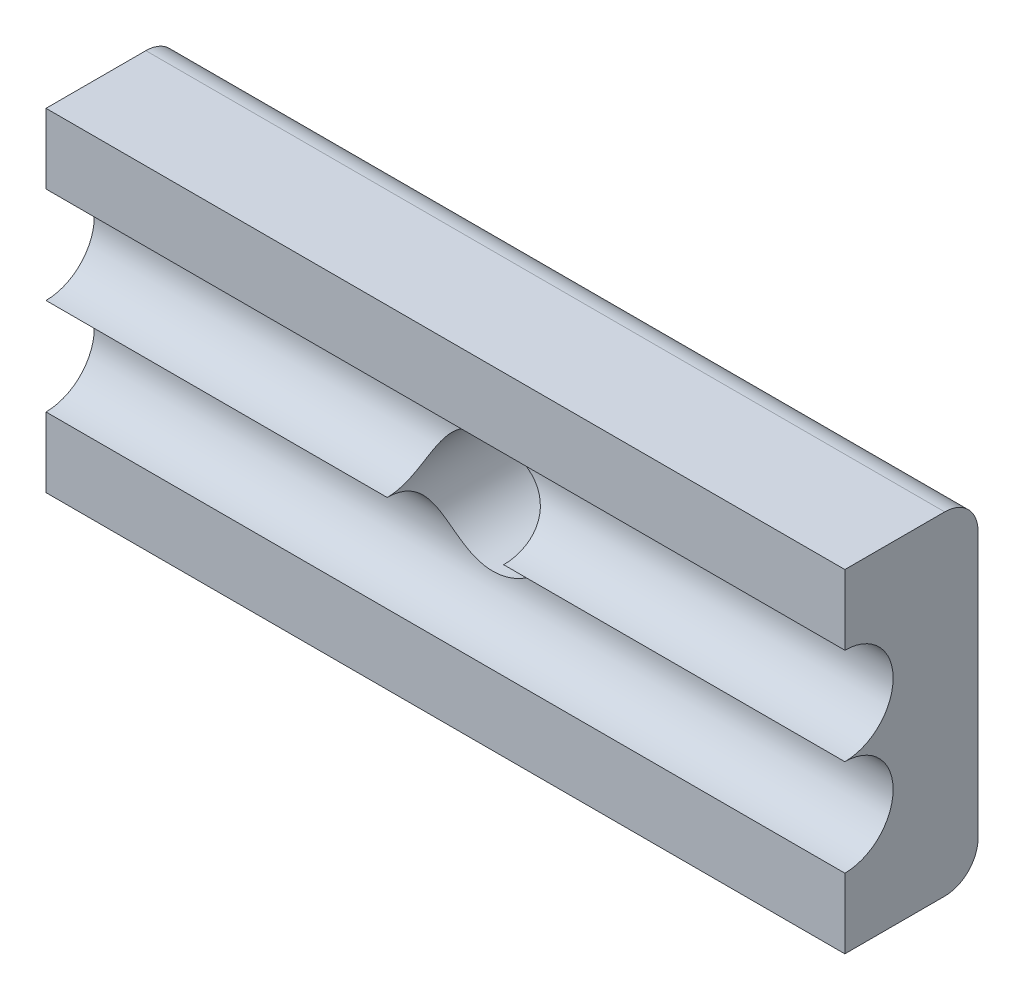
ISO-10303-21;
HEADER;
FILE_DESCRIPTION(('STEP AP214'),'2;1');
FILE_NAME('part.step','',(''),(''),'','','');
FILE_SCHEMA(('AUTOMOTIVE_DESIGN { 1 0 10303 214 1 1 1 1 }'));
ENDSEC;
DATA;
#1=APPLICATION_CONTEXT('core data for automotive mechanical design processes');
#2=APPLICATION_PROTOCOL_DEFINITION('international standard','automotive_design',2000,#1);
#3=PRODUCT_CONTEXT('',#1,'mechanical');
#4=PRODUCT('Part','Part','',(#3));
#5=PRODUCT_RELATED_PRODUCT_CATEGORY('part','',(#4));
#6=PRODUCT_DEFINITION_FORMATION('','',#4);
#7=PRODUCT_DEFINITION_CONTEXT('part definition',#1,'design');
#8=PRODUCT_DEFINITION('design','',#6,#7);
#9=PRODUCT_DEFINITION_SHAPE('','',#8);
#10=(LENGTH_UNIT() NAMED_UNIT(*) SI_UNIT(.MILLI.,.METRE.));
#11=(NAMED_UNIT(*) PLANE_ANGLE_UNIT() SI_UNIT($,.RADIAN.));
#12=(NAMED_UNIT(*) SI_UNIT($,.STERADIAN.) SOLID_ANGLE_UNIT());
#13=UNCERTAINTY_MEASURE_WITH_UNIT(LENGTH_MEASURE(1.E-05),#10,'distance_accuracy_value','');
#14=(GEOMETRIC_REPRESENTATION_CONTEXT(3) GLOBAL_UNCERTAINTY_ASSIGNED_CONTEXT((#13)) GLOBAL_UNIT_ASSIGNED_CONTEXT((#10,
#11,#12)) REPRESENTATION_CONTEXT('',''));
#15=CARTESIAN_POINT('',(0.,0.,0.));
#16=DIRECTION('',(0.,0.,1.));
#17=DIRECTION('',(1.,0.,0.));
#18=AXIS2_PLACEMENT_3D('',#15,#16,#17);
#19=CARTESIAN_POINT('',(0.,0.,4.));
#20=DIRECTION('',(0.,0.,1.));
#21=DIRECTION('',(1.,0.,0.));
#22=AXIS2_PLACEMENT_3D('',#19,#20,#21);
#23=PLANE('',#22);
#24=DIRECTION('',(-1.,0.,0.));
#25=VECTOR('',#24,1.);
#26=CARTESIAN_POINT('',(24.957345971564,1.9,4.));
#27=LINE('',#26,#25);
#28=CARTESIAN_POINT('',(18.957345971564,1.9,4.));
#29=VERTEX_POINT('',#28);
#30=CARTESIAN_POINT('',(-5.04265402843602,1.9,4.));
#31=VERTEX_POINT('',#30);
#32=EDGE_CURVE('E130',#29,#31,#27,.T.);
#33=ORIENTED_EDGE('',*,*,#32,.F.);
#34=DIRECTION('',(0.,1.,0.));
#35=VECTOR('',#34,1.);
#36=CARTESIAN_POINT('',(18.957345971564,4.,4.));
#37=LINE('',#36,#35);
#38=CARTESIAN_POINT('',(18.957345971564,4.,4.));
#39=VERTEX_POINT('',#38);
#40=EDGE_CURVE('E157',#29,#39,#37,.T.);
#41=ORIENTED_EDGE('',*,*,#40,.T.);
#42=DIRECTION('',(-1.,0.,0.));
#43=VECTOR('',#42,1.);
#44=CARTESIAN_POINT('',(-5.04265402843602,4.,4.));
#45=LINE('',#44,#43);
#46=CARTESIAN_POINT('',(-5.04265402843602,4.,4.));
#47=VERTEX_POINT('',#46);
#48=EDGE_CURVE('E152',#39,#47,#45,.T.);
#49=ORIENTED_EDGE('',*,*,#48,.T.);
#50=DIRECTION('',(0.,-1.,0.));
#51=VECTOR('',#50,1.);
#52=CARTESIAN_POINT('',(-5.04265402843602,4.,4.));
#53=LINE('',#52,#51);
#54=EDGE_CURVE('E147',#47,#31,#53,.T.);
#55=ORIENTED_EDGE('',*,*,#54,.T.);
#56=EDGE_LOOP('',(#33,#41,#49,#55));
#57=FACE_BOUND('',#56,.T.);
#58=ADVANCED_FACE('F45',(#57),#23,.T.);
#59=CARTESIAN_POINT('',(-5.04265402843602,4.,4.));
#60=DIRECTION('',(1.,0.,0.));
#61=DIRECTION('',(0.,1.,0.));
#62=AXIS2_PLACEMENT_3D('',#59,#60,#61);
#63=PLANE('',#62);
#64=CARTESIAN_POINT('',(-5.04265402843602,-2.45,4.));
#65=DIRECTION('',(-1.,0.,0.));
#66=DIRECTION('',(0.,0.,1.));
#67=AXIS2_PLACEMENT_3D('',#64,#65,#66);
#68=CIRCLE('',#67,1.45);
#69=CARTESIAN_POINT('',(-5.04265402843602,-1.,4.));
#70=VERTEX_POINT('',#69);
#71=CARTESIAN_POINT('',(-5.04265402843602,-3.9,4.));
#72=VERTEX_POINT('',#71);
#73=EDGE_CURVE('E149',#70,#72,#68,.T.);
#74=ORIENTED_EDGE('',*,*,#73,.F.);
#75=CARTESIAN_POINT('',(-5.04265402843602,0.449999999999999,4.));
#76=DIRECTION('',(-1.,0.,0.));
#77=DIRECTION('',(0.,0.,1.));
#78=AXIS2_PLACEMENT_3D('',#75,#76,#77);
#79=CIRCLE('',#78,1.45);
#80=EDGE_CURVE('E133',#31,#70,#79,.T.);
#81=ORIENTED_EDGE('',*,*,#80,.F.);
#82=ORIENTED_EDGE('',*,*,#54,.F.);
#83=DIRECTION('',(0.,0.,-1.));
#84=VECTOR('',#83,1.);
#85=CARTESIAN_POINT('',(-5.04265402843602,4.,4.));
#86=LINE('',#85,#84);
#87=CARTESIAN_POINT('',(-5.04265402843602,4.,1.));
#88=VERTEX_POINT('',#87);
#89=EDGE_CURVE('E168',#47,#88,#86,.T.);
#90=ORIENTED_EDGE('',*,*,#89,.T.);
#91=CARTESIAN_POINT('',(-5.04265402843602,3.,1.));
#92=DIRECTION('',(1.,0.,0.));
#93=DIRECTION('',(0.,1.,0.));
#94=AXIS2_PLACEMENT_3D('',#91,#92,#93);
#95=CIRCLE('',#94,1.);
#96=CARTESIAN_POINT('',(-5.04265402843602,3.,0.));
#97=VERTEX_POINT('',#96);
#98=EDGE_CURVE('E66',#88,#97,#95,.F.);
#99=ORIENTED_EDGE('',*,*,#98,.T.);
#100=DIRECTION('',(0.,-1.,0.));
#101=VECTOR('',#100,1.);
#102=CARTESIAN_POINT('',(-5.04265402843602,4.,0.));
#103=LINE('',#102,#101);
#104=CARTESIAN_POINT('',(-5.04265402843602,-5.,0.));
#105=VERTEX_POINT('',#104);
#106=EDGE_CURVE('E169',#97,#105,#103,.T.);
#107=ORIENTED_EDGE('',*,*,#106,.T.);
#108=CARTESIAN_POINT('',(-5.04265402843602,-5.,1.));
#109=DIRECTION('',(1.,0.,0.));
#110=DIRECTION('',(0.,1.,0.));
#111=AXIS2_PLACEMENT_3D('',#108,#109,#110);
#112=CIRCLE('',#111,1.);
#113=CARTESIAN_POINT('',(-5.04265402843602,-6.,1.));
#114=VERTEX_POINT('',#113);
#115=EDGE_CURVE('E197',#105,#114,#112,.F.);
#116=ORIENTED_EDGE('',*,*,#115,.T.);
#117=DIRECTION('',(0.,0.,-1.));
#118=VECTOR('',#117,1.);
#119=CARTESIAN_POINT('',(-5.04265402843602,-6.,4.));
#120=LINE('',#119,#118);
#121=CARTESIAN_POINT('',(-5.04265402843602,-6.,4.));
#122=VERTEX_POINT('',#121);
#123=EDGE_CURVE('E181',#122,#114,#120,.T.);
#124=ORIENTED_EDGE('',*,*,#123,.F.);
#125=EDGE_CURVE('E155',#72,#122,#53,.T.);
#126=ORIENTED_EDGE('',*,*,#125,.F.);
#127=EDGE_LOOP('',(#74,#81,#82,#90,#99,#107,#116,#124,#126));
#128=FACE_BOUND('',#127,.T.);
#129=ADVANCED_FACE('F145',(#128),#63,.F.);
#130=CARTESIAN_POINT('',(-5.04265402843602,-6.,4.));
#131=DIRECTION('',(0.,1.,0.));
#132=DIRECTION('',(0.,0.,1.));
#133=AXIS2_PLACEMENT_3D('',#130,#131,#132);
#134=PLANE('',#133);
#135=ORIENTED_EDGE('',*,*,#123,.T.);
#136=DIRECTION('',(1.,0.,0.));
#137=VECTOR('',#136,1.);
#138=CARTESIAN_POINT('',(-5.04265402843602,-6.,1.));
#139=LINE('',#138,#137);
#140=CARTESIAN_POINT('',(18.957345971564,-6.,1.));
#141=VERTEX_POINT('',#140);
#142=EDGE_CURVE('E184',#114,#141,#139,.T.);
#143=ORIENTED_EDGE('',*,*,#142,.T.);
#144=DIRECTION('',(0.,0.,-1.));
#145=VECTOR('',#144,1.);
#146=CARTESIAN_POINT('',(18.957345971564,-6.,4.));
#147=LINE('',#146,#145);
#148=CARTESIAN_POINT('',(18.957345971564,-6.,4.));
#149=VERTEX_POINT('',#148);
#150=EDGE_CURVE('E178',#149,#141,#147,.T.);
#151=ORIENTED_EDGE('',*,*,#150,.F.);
#152=DIRECTION('',(1.,0.,0.));
#153=VECTOR('',#152,1.);
#154=CARTESIAN_POINT('',(-5.04265402843602,-6.,4.));
#155=LINE('',#154,#153);
#156=EDGE_CURVE('E154',#122,#149,#155,.T.);
#157=ORIENTED_EDGE('',*,*,#156,.F.);
#158=EDGE_LOOP('',(#135,#143,#151,#157));
#159=FACE_BOUND('',#158,.T.);
#160=ADVANCED_FACE('F212',(#159),#134,.F.);
#161=CARTESIAN_POINT('',(18.957345971564,4.,4.));
#162=DIRECTION('',(-1.,0.,0.));
#163=DIRECTION('',(0.,0.,1.));
#164=AXIS2_PLACEMENT_3D('',#161,#162,#163);
#165=PLANE('',#164);
#166=ORIENTED_EDGE('',*,*,#40,.F.);
#167=CARTESIAN_POINT('',(18.957345971564,0.449999999999999,4.));
#168=DIRECTION('',(-1.,0.,0.));
#169=DIRECTION('',(0.,0.,1.));
#170=AXIS2_PLACEMENT_3D('',#167,#168,#169);
#171=CIRCLE('',#170,1.45);
#172=CARTESIAN_POINT('',(18.957345971564,-1.,4.));
#173=VERTEX_POINT('',#172);
#174=EDGE_CURVE('E136',#29,#173,#171,.T.);
#175=ORIENTED_EDGE('',*,*,#174,.T.);
#176=CARTESIAN_POINT('',(18.957345971564,-2.45,4.));
#177=DIRECTION('',(-1.,0.,0.));
#178=DIRECTION('',(0.,0.,1.));
#179=AXIS2_PLACEMENT_3D('',#176,#177,#178);
#180=CIRCLE('',#179,1.45);
#181=CARTESIAN_POINT('',(18.957345971564,-3.9,4.));
#182=VERTEX_POINT('',#181);
#183=EDGE_CURVE('E161',#173,#182,#180,.T.);
#184=ORIENTED_EDGE('',*,*,#183,.T.);
#185=EDGE_CURVE('E164',#149,#182,#37,.T.);
#186=ORIENTED_EDGE('',*,*,#185,.F.);
#187=ORIENTED_EDGE('',*,*,#150,.T.);
#188=CARTESIAN_POINT('',(18.957345971564,-5.,1.));
#189=DIRECTION('',(-1.,0.,0.));
#190=DIRECTION('',(0.,0.,1.));
#191=AXIS2_PLACEMENT_3D('',#188,#189,#190);
#192=CIRCLE('',#191,1.);
#193=CARTESIAN_POINT('',(18.957345971564,-5.,0.));
#194=VERTEX_POINT('',#193);
#195=EDGE_CURVE('E191',#141,#194,#192,.F.);
#196=ORIENTED_EDGE('',*,*,#195,.T.);
#197=DIRECTION('',(0.,1.,0.));
#198=VECTOR('',#197,1.);
#199=CARTESIAN_POINT('',(18.957345971564,4.,0.));
#200=LINE('',#199,#198);
#201=CARTESIAN_POINT('',(18.957345971564,3.,0.));
#202=VERTEX_POINT('',#201);
#203=EDGE_CURVE('E159',#194,#202,#200,.T.);
#204=ORIENTED_EDGE('',*,*,#203,.T.);
#205=CARTESIAN_POINT('',(18.957345971564,3.,1.));
#206=DIRECTION('',(-1.,0.,0.));
#207=DIRECTION('',(0.,0.,1.));
#208=AXIS2_PLACEMENT_3D('',#205,#206,#207);
#209=CIRCLE('',#208,1.);
#210=CARTESIAN_POINT('',(18.957345971564,4.,1.));
#211=VERTEX_POINT('',#210);
#212=EDGE_CURVE('E189',#202,#211,#209,.F.);
#213=ORIENTED_EDGE('',*,*,#212,.T.);
#214=DIRECTION('',(0.,0.,-1.));
#215=VECTOR('',#214,1.);
#216=CARTESIAN_POINT('',(18.957345971564,4.,4.));
#217=LINE('',#216,#215);
#218=EDGE_CURVE('E175',#39,#211,#217,.T.);
#219=ORIENTED_EDGE('',*,*,#218,.F.);
#220=EDGE_LOOP('',(#166,#175,#184,#186,#187,#196,#204,#213,#219));
#221=FACE_BOUND('',#220,.T.);
#222=ADVANCED_FACE('F205',(#221),#165,.F.);
#223=CARTESIAN_POINT('',(-5.04265402843602,4.,4.));
#224=DIRECTION('',(0.,-1.,0.));
#225=DIRECTION('',(0.,0.,-1.));
#226=AXIS2_PLACEMENT_3D('',#223,#224,#225);
#227=PLANE('',#226);
#228=ORIENTED_EDGE('',*,*,#218,.T.);
#229=DIRECTION('',(-1.,0.,0.));
#230=VECTOR('',#229,1.);
#231=CARTESIAN_POINT('',(-5.04265402843602,4.,1.));
#232=LINE('',#231,#230);
#233=EDGE_CURVE('E59',#211,#88,#232,.T.);
#234=ORIENTED_EDGE('',*,*,#233,.T.);
#235=ORIENTED_EDGE('',*,*,#89,.F.);
#236=ORIENTED_EDGE('',*,*,#48,.F.);
#237=EDGE_LOOP('',(#228,#234,#235,#236));
#238=FACE_BOUND('',#237,.T.);
#239=ADVANCED_FACE('F199',(#238),#227,.F.);
#240=DIRECTION('',(-1.,0.,0.));
#241=VECTOR('',#240,1.);
#242=CARTESIAN_POINT('',(24.957345971564,-3.9,4.));
#243=LINE('',#242,#241);
#244=EDGE_CURVE('E218',#182,#72,#243,.T.);
#245=ORIENTED_EDGE('',*,*,#244,.T.);
#246=ORIENTED_EDGE('',*,*,#125,.T.);
#247=ORIENTED_EDGE('',*,*,#156,.T.);
#248=ORIENTED_EDGE('',*,*,#185,.T.);
#249=EDGE_LOOP('',(#245,#246,#247,#248));
#250=FACE_BOUND('',#249,.T.);
#251=ADVANCED_FACE('F217',(#250),#23,.T.);
#252=CARTESIAN_POINT('',(0.,0.,0.));
#253=DIRECTION('',(0.,0.,1.));
#254=DIRECTION('',(1.,0.,0.));
#255=AXIS2_PLACEMENT_3D('',#252,#253,#254);
#256=PLANE('',#255);
#257=CARTESIAN_POINT('',(6.95734597156398,-1.,0.));
#258=DIRECTION('',(0.,0.,1.));
#259=DIRECTION('',(1.,0.,0.));
#260=AXIS2_PLACEMENT_3D('',#257,#258,#259);
#261=CIRCLE('',#260,1.75);
#262=CARTESIAN_POINT('',(8.70734597156398,-1.,0.));
#263=VERTEX_POINT('',#262);
#264=EDGE_CURVE('E171',#263,#263,#261,.T.);
#265=ORIENTED_EDGE('',*,*,#264,.T.);
#266=EDGE_LOOP('',(#265));
#267=FACE_BOUND('',#266,.T.);
#268=ORIENTED_EDGE('',*,*,#203,.F.);
#269=DIRECTION('',(1.,0.,0.));
#270=VECTOR('',#269,1.);
#271=CARTESIAN_POINT('',(0.,-5.,0.));
#272=LINE('',#271,#270);
#273=EDGE_CURVE('E74',#194,#105,#272,.F.);
#274=ORIENTED_EDGE('',*,*,#273,.T.);
#275=ORIENTED_EDGE('',*,*,#106,.F.);
#276=DIRECTION('',(-1.,0.,0.));
#277=VECTOR('',#276,1.);
#278=CARTESIAN_POINT('',(0.,3.,0.));
#279=LINE('',#278,#277);
#280=EDGE_CURVE('E193',#97,#202,#279,.F.);
#281=ORIENTED_EDGE('',*,*,#280,.T.);
#282=EDGE_LOOP('',(#268,#274,#275,#281));
#283=FACE_BOUND('',#282,.T.);
#284=ADVANCED_FACE('F203',(#267,#283),#256,.F.);
#285=CARTESIAN_POINT('',(6.95734597156398,-1.,-1.));
#286=DIRECTION('',(0.,0.,1.));
#287=DIRECTION('',(1.,0.,0.));
#288=AXIS2_PLACEMENT_3D('',#285,#286,#287);
#289=CYLINDRICAL_SURFACE('',#288,1.75);
#290=CARTESIAN_POINT('',(5.20734597156398,-1.,4.));
#291=CARTESIAN_POINT('',(5.20735628796787,-0.999996233307955,3.95950347170287));
#292=CARTESIAN_POINT('',(5.20734623615223,-1.00169651874957,3.91900882092507));
#293=CARTESIAN_POINT('',(5.20736048938849,-1.008475983876,3.83830406462161));
#294=CARTESIAN_POINT('',(5.20738479379075,-1.01355509966984,3.79809395373006));
#295=CARTESIAN_POINT('',(5.20754292296388,-1.02706946870552,3.71819937660366));
#296=CARTESIAN_POINT('',(5.20767685232293,-1.03550792298866,3.67851544913332));
#297=CARTESIAN_POINT('',(5.20820298378966,-1.05567233962938,3.60000573424634));
#298=CARTESIAN_POINT('',(5.20859518264275,-1.0673982605587,3.56117993602232));
#299=CARTESIAN_POINT('',(5.21043819033338,-1.10742336737427,3.44633214027787));
#300=CARTESIAN_POINT('',(5.21255540910154,-1.14056992740874,3.37193956453441));
#301=CARTESIAN_POINT('',(5.22062480405629,-1.21870168113885,3.22995484600408));
#302=CARTESIAN_POINT('',(5.22657444796822,-1.26367904602915,3.162358246847));
#303=CARTESIAN_POINT('',(5.24457291725175,-1.3624224693536,3.03781091559414));
#304=CARTESIAN_POINT('',(5.25644936844873,-1.41591256647713,2.98061838335936));
#305=CARTESIAN_POINT('',(5.28848554166723,-1.52999312735375,2.87659943638053));
#306=CARTESIAN_POINT('',(5.30863653009887,-1.5905760567279,2.8297621718278));
#307=CARTESIAN_POINT('',(5.35630367173989,-1.70910053475405,2.75176338537125));
#308=CARTESIAN_POINT('',(5.38287989579919,-1.76669880880151,2.71950161011116));
#309=CARTESIAN_POINT('',(5.44440527805058,-1.88191255875245,2.66438935345029));
#310=CARTESIAN_POINT('',(5.47935427559974,-1.93952803430472,2.64153869150749));
#311=CARTESIAN_POINT('',(5.55573571144403,-2.04991879019691,2.60511840940971));
#312=CARTESIAN_POINT('',(5.59687609157522,-2.10279454363909,2.59123306506017));
#313=CARTESIAN_POINT('',(5.68570730350766,-2.20415248561638,2.57005451842911));
#314=CARTESIAN_POINT('',(5.7334005050219,-2.25263307414154,2.56276370821136));
#315=CARTESIAN_POINT('',(5.84045587549127,-2.34939610956544,2.55257950012423));
#316=CARTESIAN_POINT('',(5.90053161601968,-2.39695216282198,2.55032111248084));
#317=CARTESIAN_POINT('',(6.02639946014559,-2.4838127973303,2.54974267812244));
#318=CARTESIAN_POINT('',(6.09219601661633,-2.52311086809718,2.55142572618354));
#319=CARTESIAN_POINT('',(6.24121932472904,-2.59935160342842,2.55711153973906));
#320=CARTESIAN_POINT('',(6.32538667751418,-2.63443751935302,2.56149337456995));
#321=CARTESIAN_POINT('',(6.49816365217053,-2.69113160227651,2.5699022741655));
#322=CARTESIAN_POINT('',(6.5867743026413,-2.71273663281605,2.57392925618317));
#323=CARTESIAN_POINT('',(6.77370533303878,-2.74311373166546,2.5798392153089));
#324=CARTESIAN_POINT('',(6.87222900805988,-2.7506982291386,2.58152101970474));
#325=CARTESIAN_POINT('',(7.06913178301928,-2.74920016543393,2.58120530363571));
#326=CARTESIAN_POINT('',(7.1675108866571,-2.7401180384494,2.57920787902086));
#327=CARTESIAN_POINT('',(7.35937724259397,-2.70592598115926,2.57266353858147));
#328=CARTESIAN_POINT('',(7.45292222792879,-2.68112825617197,2.56816648948252));
#329=CARTESIAN_POINT('',(7.6347365464983,-2.61646917914677,2.55921862613383));
#330=CARTESIAN_POINT('',(7.72300062120785,-2.57659309257076,2.55476786149854));
#331=CARTESIAN_POINT('',(7.89380954184982,-2.48164115030977,2.54955215704365));
#332=CARTESIAN_POINT('',(7.97618390137364,-2.42624748516284,2.54887124389184));
#333=CARTESIAN_POINT('',(8.0915592220454,-2.33360489747453,2.55435009452865));
#334=CARTESIAN_POINT('',(8.12863812223731,-2.30114913500813,2.55725691992886));
#335=CARTESIAN_POINT('',(8.1997593662636,-2.23341700978732,2.56585968006157));
#336=CARTESIAN_POINT('',(8.23380305216163,-2.19814190686118,2.57155437479489));
#337=CARTESIAN_POINT('',(8.31270400953542,-2.10923687749278,2.58959700756132));
#338=CARTESIAN_POINT('',(8.35575995043016,-2.05433921565457,2.60376715046082));
#339=CARTESIAN_POINT('',(8.43387180879001,-1.94183739378567,2.64067423260524));
#340=CARTESIAN_POINT('',(8.46893451988635,-1.88423558267373,2.66340385304469));
#341=CARTESIAN_POINT('',(8.53078241472423,-1.76882849482422,2.71836185540442));
#342=CARTESIAN_POINT('',(8.55754247549406,-1.71102312568498,2.75061850127359));
#343=CARTESIAN_POINT('',(8.60300857643246,-1.59832734334629,2.82454458266642));
#344=CARTESIAN_POINT('',(8.62171231256021,-1.54343776796869,2.86621670574914));
#345=CARTESIAN_POINT('',(8.65153931157698,-1.44148952447236,2.95605390237653));
#346=CARTESIAN_POINT('',(8.66295962528092,-1.39419270411139,3.00385308734594));
#347=CARTESIAN_POINT('',(8.68090977955656,-1.30633705195076,3.10608589552964));
#348=CARTESIAN_POINT('',(8.68743820643928,-1.26578017053515,3.16052143127921));
#349=CARTESIAN_POINT('',(8.69749255780848,-1.18968857244684,3.279255600521));
#350=CARTESIAN_POINT('',(8.70074043134115,-1.15480403214715,3.34399372073236));
#351=CARTESIAN_POINT('',(8.70501084628032,-1.09520541799972,3.47806311938934));
#352=CARTESIAN_POINT('',(8.70603278443627,-1.07049410266791,3.54739563771797));
#353=CARTESIAN_POINT('',(8.70709373356957,-1.03420254664772,3.68036115519717));
#354=CARTESIAN_POINT('',(8.7072374627884,-1.02138800526271,3.74365737226552));
#355=CARTESIAN_POINT('',(8.70732959344063,-1.00856261758939,3.83938855927058));
#356=CARTESIAN_POINT('',(8.70733973950154,-1.00535356266141,3.8714218920228));
#357=CARTESIAN_POINT('',(8.70734630520286,-1.00107208639006,3.93563387905301));
#358=CARTESIAN_POINT('',(8.7073427236325,-0.999999853528685,3.96781254589955));
#359=CARTESIAN_POINT('',(8.70734597156398,-1.,4.));
#360=B_SPLINE_CURVE_WITH_KNOTS('',3,(#290,#291,#292,#293,#294,#295,#296,#297,#298,#299,#300,
#301,#302,#303,#304,#305,#306,#307,#308,#309,#310,#311,#312,#313,#314,#315,#316,#317,#318,#319,
#320,#321,#322,#323,#324,#325,#326,#327,#328,#329,#330,#331,#332,#333,#334,#335,#336,#337,#338,
#339,#340,#341,#342,#343,#344,#345,#346,#347,#348,#349,#350,#351,#352,#353,#354,#355,#356,#357,
#358,#359),.UNSPECIFIED.,.F.,.F.,(4,2,2,2,2,2,2,2,2,2,2,2,2,2,2,2,2,2,2,2,2,2,2,2,2,2,2,2,2,2,2,
2,2,2,4),(0.,0.121450491150878,0.242898685835263,0.36446288395356,0.486025550203311,
0.729150350388306,0.972114670434952,1.20839190408096,1.44442039078178,1.65680662860573,
1.86918879183998,2.07361170715427,2.27810874397028,2.50722300397813,2.73651722253453,
3.00925200180987,3.28205021185212,3.57705108684688,3.87204427668725,4.1613533610251,
4.45094589118067,4.74696796029453,4.89484307179298,5.04265247050917,5.25525370736707,
5.46767357018101,5.68073006254754,5.89384744687994,6.09759770470148,6.30140682090117,
6.52132238183589,6.74129753465547,6.93443222433302,7.03095072760383,7.12747774407541),.UNSPECIFIED.);
#361=CARTESIAN_POINT('',(5.20734597156398,-1.,4.));
#362=VERTEX_POINT('',#361);
#363=CARTESIAN_POINT('',(8.70734597156398,-1.,4.));
#364=VERTEX_POINT('',#363);
#365=EDGE_CURVE('E12',#362,#364,#360,.T.);
#366=ORIENTED_EDGE('',*,*,#365,.T.);
#367=CARTESIAN_POINT('',(8.70734597156398,-1.,4.));
#368=CARTESIAN_POINT('',(8.70733565516009,-1.00000376669205,3.95950347170287));
#369=CARTESIAN_POINT('',(8.70734570697573,-0.998303481250434,3.91900882092507));
#370=CARTESIAN_POINT('',(8.70733145373947,-0.991524016123998,3.83830406462161));
#371=CARTESIAN_POINT('',(8.70730714933721,-0.986444900330157,3.79809395373006));
#372=CARTESIAN_POINT('',(8.70714902016408,-0.972930531294483,3.71819937660366));
#373=CARTESIAN_POINT('',(8.70701509080503,-0.964492077011337,3.67851544913332));
#374=CARTESIAN_POINT('',(8.7064889593383,-0.944327660370616,3.60000573424634));
#375=CARTESIAN_POINT('',(8.70609676048522,-0.932601739441299,3.56117993602232));
#376=CARTESIAN_POINT('',(8.70425375279459,-0.892576632625728,3.44633214027787));
#377=CARTESIAN_POINT('',(8.70213653402643,-0.859430072591264,3.37193956453441));
#378=CARTESIAN_POINT('',(8.69406713907167,-0.781298318861148,3.22995484600408));
#379=CARTESIAN_POINT('',(8.68811749515974,-0.73632095397085,3.162358246847));
#380=CARTESIAN_POINT('',(8.67011902587622,-0.637577530646402,3.03781091559414));
#381=CARTESIAN_POINT('',(8.65824257467923,-0.58408743352287,2.98061838335936));
#382=CARTESIAN_POINT('',(8.62620640146073,-0.470006872646247,2.87659943638053));
#383=CARTESIAN_POINT('',(8.60605541302909,-0.409423943272102,2.8297621718278));
#384=CARTESIAN_POINT('',(8.55838827138807,-0.290899465245946,2.75176338537125));
#385=CARTESIAN_POINT('',(8.53181204732878,-0.233301191198493,2.71950161011116));
#386=CARTESIAN_POINT('',(8.47028666507739,-0.118087441247552,2.66438935345029));
#387=CARTESIAN_POINT('',(8.43533766752823,-0.0604719656952775,2.64153869150749));
#388=CARTESIAN_POINT('',(8.35895623168394,0.0499187901969046,2.60511840940971));
#389=CARTESIAN_POINT('',(8.31781585155274,0.102794543639089,2.59123306506017));
#390=CARTESIAN_POINT('',(8.22898463962031,0.204152485616383,2.57005451842911));
#391=CARTESIAN_POINT('',(8.18129143810607,0.252633074141544,2.56276370821136));
#392=CARTESIAN_POINT('',(8.0742360676367,0.349396109565439,2.55257950012423));
#393=CARTESIAN_POINT('',(8.01416032710829,0.396952162821982,2.55032111248084));
#394=CARTESIAN_POINT('',(7.88829248298237,0.483812797330298,2.54974267812244));
#395=CARTESIAN_POINT('',(7.82249592651164,0.523110868097183,2.55142572618354));
#396=CARTESIAN_POINT('',(7.67347261839893,0.599351603428421,2.55711153973906));
#397=CARTESIAN_POINT('',(7.58930526561379,0.634437519353015,2.56149337456995));
#398=CARTESIAN_POINT('',(7.41652829095744,0.691131602276504,2.5699022741655));
#399=CARTESIAN_POINT('',(7.32791764048666,0.712736632816051,2.57392925618317));
#400=CARTESIAN_POINT('',(7.14098661008918,0.743113731665461,2.5798392153089));
#401=CARTESIAN_POINT('',(7.04246293506809,0.750698229138602,2.58152101970474));
#402=CARTESIAN_POINT('',(6.84556016010869,0.749200165433929,2.58120530363571));
#403=CARTESIAN_POINT('',(6.74718105647086,0.740118038449403,2.57920787902086));
#404=CARTESIAN_POINT('',(6.555314700534,0.70592598115926,2.57266353858147));
#405=CARTESIAN_POINT('',(6.46176971519918,0.68112825617197,2.56816648948252));
#406=CARTESIAN_POINT('',(6.27995539662967,0.616469179146767,2.55921862613383));
#407=CARTESIAN_POINT('',(6.19169132192012,0.576593092570759,2.55476786149854));
#408=CARTESIAN_POINT('',(6.02088240127815,0.48164115030977,2.54955215704365));
#409=CARTESIAN_POINT('',(5.93850804175433,0.426247485162836,2.54887124389183));
#410=CARTESIAN_POINT('',(5.82313272108256,0.333604897474526,2.55435009452865));
#411=CARTESIAN_POINT('',(5.78605382089066,0.301149135008133,2.55725691992886));
#412=CARTESIAN_POINT('',(5.71493257686436,0.233417009787317,2.56585968006157));
#413=CARTESIAN_POINT('',(5.68088889096634,0.19814190686118,2.57155437479489));
#414=CARTESIAN_POINT('',(5.60198793359255,0.109236877492779,2.58959700756132));
#415=CARTESIAN_POINT('',(5.55893199269781,0.0543392156545724,2.60376715046082));
#416=CARTESIAN_POINT('',(5.48082013433796,-0.0581626062143289,2.64067423260524));
#417=CARTESIAN_POINT('',(5.44575742324161,-0.115764417326271,2.66340385304469));
#418=CARTESIAN_POINT('',(5.38390952840373,-0.231171505175781,2.71836185540442));
#419=CARTESIAN_POINT('',(5.3571494676339,-0.288976874315022,2.75061850127359));
#420=CARTESIAN_POINT('',(5.31168336669551,-0.401672656653716,2.82454458266642));
#421=CARTESIAN_POINT('',(5.29297963056775,-0.456562232031308,2.86621670574914));
#422=CARTESIAN_POINT('',(5.26315263155098,-0.558510475527645,2.95605390237653));
#423=CARTESIAN_POINT('',(5.25173231784705,-0.605807295888607,3.00385308734594));
#424=CARTESIAN_POINT('',(5.23378216357141,-0.693662948049236,3.10608589552964));
#425=CARTESIAN_POINT('',(5.22725373668868,-0.734219829464851,3.16052143127921));
#426=CARTESIAN_POINT('',(5.21719938531948,-0.810311427553164,3.279255600521));
#427=CARTESIAN_POINT('',(5.21395151178682,-0.845195967852847,3.34399372073236));
#428=CARTESIAN_POINT('',(5.20968109684765,-0.904794582000283,3.47806311938934));
#429=CARTESIAN_POINT('',(5.20865915869169,-0.929505897332093,3.54739563771797));
#430=CARTESIAN_POINT('',(5.2075982095584,-0.965797453352283,3.68036115519717));
#431=CARTESIAN_POINT('',(5.20745448033956,-0.978611994737294,3.74365737226552));
#432=CARTESIAN_POINT('',(5.20736234968733,-0.99143738241061,3.83938855927058));
#433=CARTESIAN_POINT('',(5.20735220362643,-0.994646437338588,3.8714218920228));
#434=CARTESIAN_POINT('',(5.2073456379251,-0.99892791360994,3.93563387905301));
#435=CARTESIAN_POINT('',(5.20734921949547,-1.00000014647132,3.96781254589955));
#436=CARTESIAN_POINT('',(5.20734597156398,-1.,4.));
#437=B_SPLINE_CURVE_WITH_KNOTS('',3,(#367,#368,#369,#370,#371,#372,#373,#374,#375,#376,#377,
#378,#379,#380,#381,#382,#383,#384,#385,#386,#387,#388,#389,#390,#391,#392,#393,#394,#395,#396,
#397,#398,#399,#400,#401,#402,#403,#404,#405,#406,#407,#408,#409,#410,#411,#412,#413,#414,#415,
#416,#417,#418,#419,#420,#421,#422,#423,#424,#425,#426,#427,#428,#429,#430,#431,#432,#433,#434,
#435,#436),.UNSPECIFIED.,.F.,.F.,(4,2,2,2,2,2,2,2,2,2,2,2,2,2,2,2,2,2,2,2,2,2,2,2,2,2,2,2,2,2,2,
2,2,2,4),(0.,0.121450491150878,0.242898685835263,0.36446288395356,0.486025550203311,
0.729150350388306,0.972114670434953,1.20839190408096,1.44442039078178,1.65680662860573,
1.86918879183998,2.07361170715427,2.27810874397028,2.50722300397813,2.73651722253453,
3.00925200180987,3.28205021185212,3.57705108684687,3.87204427668725,4.1613533610251,
4.45094589118067,4.74696796029453,4.89484307179298,5.04265247050917,5.25525370736707,
5.46767357018101,5.68073006254755,5.89384744687994,6.09759770470148,6.30140682090117,
6.52132238183589,6.74129753465547,6.93443222433302,7.03095072760383,7.12747774407541),.UNSPECIFIED.);
#438=EDGE_CURVE('E140',#364,#362,#437,.T.);
#439=ORIENTED_EDGE('',*,*,#438,.T.);
#440=EDGE_LOOP('',(#366,#439));
#441=FACE_BOUND('',#440,.T.);
#442=ORIENTED_EDGE('',*,*,#264,.F.);
#443=EDGE_LOOP('',(#442));
#444=FACE_BOUND('',#443,.T.);
#445=ADVANCED_FACE('F236',(#441,#444),#289,.F.);
#446=CARTESIAN_POINT('',(-5.04265402843602,-5.,1.));
#447=DIRECTION('',(1.,0.,0.));
#448=DIRECTION('',(0.,0.,-1.));
#449=AXIS2_PLACEMENT_3D('',#446,#447,#448);
#450=CYLINDRICAL_SURFACE('',#449,1.);
#451=ORIENTED_EDGE('',*,*,#115,.F.);
#452=ORIENTED_EDGE('',*,*,#273,.F.);
#453=ORIENTED_EDGE('',*,*,#195,.F.);
#454=ORIENTED_EDGE('',*,*,#142,.F.);
#455=EDGE_LOOP('',(#451,#452,#453,#454));
#456=FACE_BOUND('',#455,.T.);
#457=ADVANCED_FACE('F207',(#456),#450,.T.);
#458=CARTESIAN_POINT('',(-5.04265402843602,3.,1.));
#459=DIRECTION('',(-1.,0.,0.));
#460=DIRECTION('',(0.,0.,1.));
#461=AXIS2_PLACEMENT_3D('',#458,#459,#460);
#462=CYLINDRICAL_SURFACE('',#461,1.);
#463=ORIENTED_EDGE('',*,*,#212,.F.);
#464=ORIENTED_EDGE('',*,*,#280,.F.);
#465=ORIENTED_EDGE('',*,*,#98,.F.);
#466=ORIENTED_EDGE('',*,*,#233,.F.);
#467=EDGE_LOOP('',(#463,#464,#465,#466));
#468=FACE_BOUND('',#467,.T.);
#469=ADVANCED_FACE('F47',(#468),#462,.T.);
#470=CARTESIAN_POINT('',(24.957345971564,-2.45,4.));
#471=DIRECTION('',(-1.,0.,0.));
#472=DIRECTION('',(0.,0.,1.));
#473=AXIS2_PLACEMENT_3D('',#470,#471,#472);
#474=CYLINDRICAL_SURFACE('',#473,1.45);
#475=DIRECTION('',(-1.,0.,0.));
#476=VECTOR('',#475,1.);
#477=CARTESIAN_POINT('',(24.957345971564,-1.,4.));
#478=LINE('',#477,#476);
#479=EDGE_CURVE('E222',#173,#364,#478,.T.);
#480=ORIENTED_EDGE('',*,*,#479,.T.);
#481=ORIENTED_EDGE('',*,*,#365,.F.);
#482=EDGE_CURVE('E225',#362,#70,#478,.T.);
#483=ORIENTED_EDGE('',*,*,#482,.T.);
#484=ORIENTED_EDGE('',*,*,#73,.T.);
#485=ORIENTED_EDGE('',*,*,#244,.F.);
#486=ORIENTED_EDGE('',*,*,#183,.F.);
#487=EDGE_LOOP('',(#480,#481,#483,#484,#485,#486));
#488=FACE_BOUND('',#487,.T.);
#489=ADVANCED_FACE('F241',(#488),#474,.F.);
#490=CARTESIAN_POINT('',(24.957345971564,0.449999999999999,4.));
#491=DIRECTION('',(-1.,0.,0.));
#492=DIRECTION('',(0.,0.,1.));
#493=AXIS2_PLACEMENT_3D('',#490,#491,#492);
#494=CYLINDRICAL_SURFACE('',#493,1.45);
#495=ORIENTED_EDGE('',*,*,#32,.T.);
#496=ORIENTED_EDGE('',*,*,#80,.T.);
#497=ORIENTED_EDGE('',*,*,#482,.F.);
#498=ORIENTED_EDGE('',*,*,#438,.F.);
#499=ORIENTED_EDGE('',*,*,#479,.F.);
#500=ORIENTED_EDGE('',*,*,#174,.F.);
#501=EDGE_LOOP('',(#495,#496,#497,#498,#499,#500));
#502=FACE_BOUND('',#501,.T.);
#503=ADVANCED_FACE('F132',(#502),#494,.F.);
#504=CLOSED_SHELL('',(#58,#129,#160,#222,#239,#251,#284,#445,#457,#469,#489,#503));
#505=MANIFOLD_SOLID_BREP('B2',#504);
#506=ADVANCED_BREP_SHAPE_REPRESENTATION('',(#18,#505),#14);
#507=SHAPE_DEFINITION_REPRESENTATION(#9,#506);
ENDSEC;
END-ISO-10303-21;
